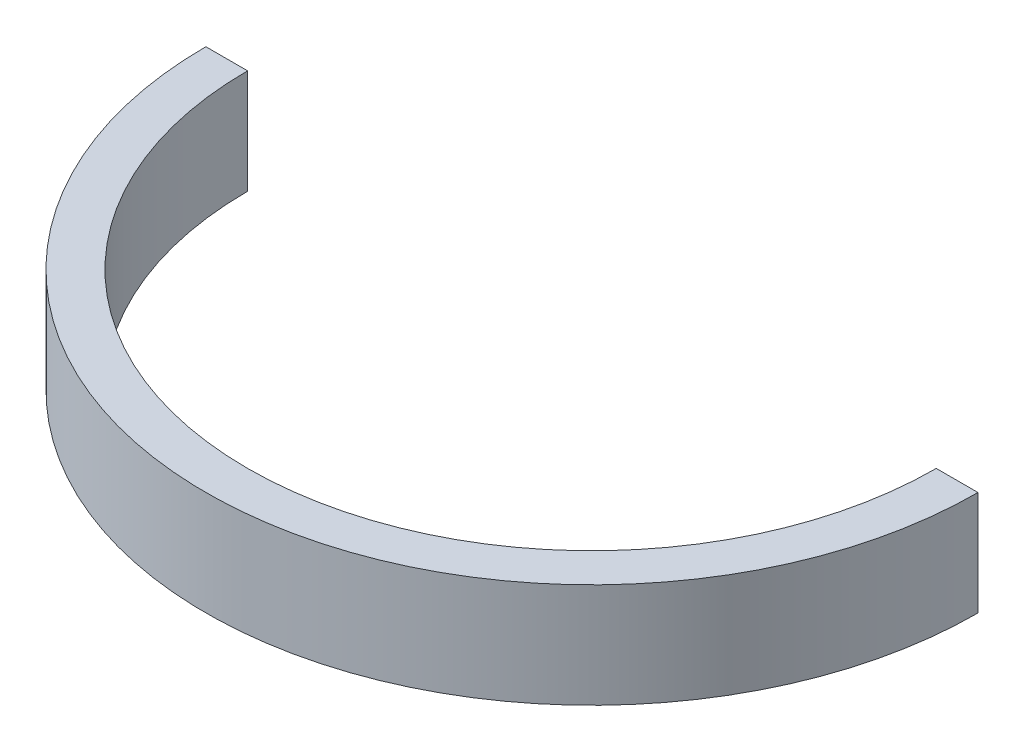
ISO-10303-21;
HEADER;
FILE_DESCRIPTION(('STEP AP214'),'2;1');
FILE_NAME('part.step','',(''),(''),'','','');
FILE_SCHEMA(('AUTOMOTIVE_DESIGN { 1 0 10303 214 1 1 1 1 }'));
ENDSEC;
DATA;
#1=APPLICATION_CONTEXT('core data for automotive mechanical design processes');
#2=APPLICATION_PROTOCOL_DEFINITION('international standard','automotive_design',2000,#1);
#3=PRODUCT_CONTEXT('',#1,'mechanical');
#4=PRODUCT('Part','Part','',(#3));
#5=PRODUCT_RELATED_PRODUCT_CATEGORY('part','',(#4));
#6=PRODUCT_DEFINITION_FORMATION('','',#4);
#7=PRODUCT_DEFINITION_CONTEXT('part definition',#1,'design');
#8=PRODUCT_DEFINITION('design','',#6,#7);
#9=PRODUCT_DEFINITION_SHAPE('','',#8);
#10=(LENGTH_UNIT() NAMED_UNIT(*) SI_UNIT(.MILLI.,.METRE.));
#11=(NAMED_UNIT(*) PLANE_ANGLE_UNIT() SI_UNIT($,.RADIAN.));
#12=(NAMED_UNIT(*) SI_UNIT($,.STERADIAN.) SOLID_ANGLE_UNIT());
#13=UNCERTAINTY_MEASURE_WITH_UNIT(LENGTH_MEASURE(1.E-05),#10,'distance_accuracy_value','');
#14=(GEOMETRIC_REPRESENTATION_CONTEXT(3) GLOBAL_UNCERTAINTY_ASSIGNED_CONTEXT((#13)) GLOBAL_UNIT_ASSIGNED_CONTEXT((#10,
#11,#12)) REPRESENTATION_CONTEXT('',''));
#15=CARTESIAN_POINT('',(0.,0.,0.));
#16=DIRECTION('',(0.,0.,1.));
#17=DIRECTION('',(1.,0.,0.));
#18=AXIS2_PLACEMENT_3D('',#15,#16,#17);
#19=CARTESIAN_POINT('',(0.,20.,0.));
#20=DIRECTION('',(0.,-1.,0.));
#21=DIRECTION('',(0.,0.,-1.));
#22=AXIS2_PLACEMENT_3D('',#19,#20,#21);
#23=CYLINDRICAL_SURFACE('',#22,66.);
#24=CARTESIAN_POINT('',(0.,0.,0.));
#25=DIRECTION('',(0.,-1.,0.));
#26=DIRECTION('',(0.,0.,1.));
#27=AXIS2_PLACEMENT_3D('',#24,#25,#26);
#28=CIRCLE('',#27,66.);
#29=CARTESIAN_POINT('',(66.,0.,0.));
#30=VERTEX_POINT('',#29);
#31=CARTESIAN_POINT('',(-66.,0.,0.));
#32=VERTEX_POINT('',#31);
#33=EDGE_CURVE('E97',#30,#32,#28,.T.);
#34=ORIENTED_EDGE('',*,*,#33,.T.);
#35=DIRECTION('',(0.,-1.,0.));
#36=VECTOR('',#35,1.);
#37=CARTESIAN_POINT('',(-66.,20.,0.));
#38=LINE('',#37,#36);
#39=CARTESIAN_POINT('',(-66.,20.,0.));
#40=VERTEX_POINT('',#39);
#41=EDGE_CURVE('E11',#40,#32,#38,.T.);
#42=ORIENTED_EDGE('',*,*,#41,.F.);
#43=CARTESIAN_POINT('',(0.,20.,0.));
#44=DIRECTION('',(0.,-1.,0.));
#45=DIRECTION('',(0.,0.,1.));
#46=AXIS2_PLACEMENT_3D('',#43,#44,#45);
#47=CIRCLE('',#46,66.);
#48=CARTESIAN_POINT('',(66.,20.,0.));
#49=VERTEX_POINT('',#48);
#50=EDGE_CURVE('E85',#49,#40,#47,.T.);
#51=ORIENTED_EDGE('',*,*,#50,.F.);
#52=DIRECTION('',(0.,-1.,0.));
#53=VECTOR('',#52,1.);
#54=CARTESIAN_POINT('',(66.,20.,0.));
#55=LINE('',#54,#53);
#56=EDGE_CURVE('E93',#49,#30,#55,.T.);
#57=ORIENTED_EDGE('',*,*,#56,.T.);
#58=EDGE_LOOP('',(#34,#42,#51,#57));
#59=FACE_BOUND('',#58,.T.);
#60=ADVANCED_FACE('F34',(#59),#23,.F.);
#61=CARTESIAN_POINT('',(-74.,20.,0.));
#62=DIRECTION('',(0.,0.,1.));
#63=DIRECTION('',(1.,0.,0.));
#64=AXIS2_PLACEMENT_3D('',#61,#62,#63);
#65=PLANE('',#64);
#66=DIRECTION('',(-1.,0.,0.));
#67=VECTOR('',#66,1.);
#68=CARTESIAN_POINT('',(-74.,0.,0.));
#69=LINE('',#68,#67);
#70=CARTESIAN_POINT('',(-74.,0.,0.));
#71=VERTEX_POINT('',#70);
#72=EDGE_CURVE('E89',#32,#71,#69,.T.);
#73=ORIENTED_EDGE('',*,*,#72,.T.);
#74=DIRECTION('',(0.,-1.,0.));
#75=VECTOR('',#74,1.);
#76=CARTESIAN_POINT('',(-74.,20.,0.));
#77=LINE('',#76,#75);
#78=CARTESIAN_POINT('',(-74.,20.,0.));
#79=VERTEX_POINT('',#78);
#80=EDGE_CURVE('E42',#79,#71,#77,.T.);
#81=ORIENTED_EDGE('',*,*,#80,.F.);
#82=DIRECTION('',(-1.,0.,0.));
#83=VECTOR('',#82,1.);
#84=CARTESIAN_POINT('',(-74.,20.,0.));
#85=LINE('',#84,#83);
#86=EDGE_CURVE('E80',#40,#79,#85,.T.);
#87=ORIENTED_EDGE('',*,*,#86,.F.);
#88=ORIENTED_EDGE('',*,*,#41,.T.);
#89=EDGE_LOOP('',(#73,#81,#87,#88));
#90=FACE_BOUND('',#89,.T.);
#91=ADVANCED_FACE('F88',(#90),#65,.F.);
#92=CARTESIAN_POINT('',(0.,20.,0.));
#93=DIRECTION('',(0.,-1.,0.));
#94=DIRECTION('',(0.,0.,-1.));
#95=AXIS2_PLACEMENT_3D('',#92,#93,#94);
#96=CYLINDRICAL_SURFACE('',#95,74.);
#97=CARTESIAN_POINT('',(0.,0.,0.));
#98=DIRECTION('',(0.,1.,0.));
#99=DIRECTION('',(0.,0.,1.));
#100=AXIS2_PLACEMENT_3D('',#97,#98,#99);
#101=CIRCLE('',#100,74.);
#102=CARTESIAN_POINT('',(74.,0.,0.));
#103=VERTEX_POINT('',#102);
#104=EDGE_CURVE('E67',#71,#103,#101,.T.);
#105=ORIENTED_EDGE('',*,*,#104,.T.);
#106=DIRECTION('',(0.,-1.,0.));
#107=VECTOR('',#106,1.);
#108=CARTESIAN_POINT('',(74.,20.,0.));
#109=LINE('',#108,#107);
#110=CARTESIAN_POINT('',(74.,20.,0.));
#111=VERTEX_POINT('',#110);
#112=EDGE_CURVE('E90',#111,#103,#109,.T.);
#113=ORIENTED_EDGE('',*,*,#112,.F.);
#114=CARTESIAN_POINT('',(0.,20.,0.));
#115=DIRECTION('',(0.,1.,0.));
#116=DIRECTION('',(0.,0.,1.));
#117=AXIS2_PLACEMENT_3D('',#114,#115,#116);
#118=CIRCLE('',#117,74.);
#119=EDGE_CURVE('E83',#79,#111,#118,.T.);
#120=ORIENTED_EDGE('',*,*,#119,.F.);
#121=ORIENTED_EDGE('',*,*,#80,.T.);
#122=EDGE_LOOP('',(#105,#113,#120,#121));
#123=FACE_BOUND('',#122,.T.);
#124=ADVANCED_FACE('F91',(#123),#96,.T.);
#125=CARTESIAN_POINT('',(66.,20.,0.));
#126=DIRECTION('',(0.,0.,1.));
#127=DIRECTION('',(1.,0.,0.));
#128=AXIS2_PLACEMENT_3D('',#125,#126,#127);
#129=PLANE('',#128);
#130=DIRECTION('',(-1.,0.,0.));
#131=VECTOR('',#130,1.);
#132=CARTESIAN_POINT('',(66.,0.,0.));
#133=LINE('',#132,#131);
#134=EDGE_CURVE('E73',#103,#30,#133,.T.);
#135=ORIENTED_EDGE('',*,*,#134,.T.);
#136=ORIENTED_EDGE('',*,*,#56,.F.);
#137=DIRECTION('',(-1.,0.,0.));
#138=VECTOR('',#137,1.);
#139=CARTESIAN_POINT('',(66.,20.,0.));
#140=LINE('',#139,#138);
#141=EDGE_CURVE('E50',#111,#49,#140,.T.);
#142=ORIENTED_EDGE('',*,*,#141,.F.);
#143=ORIENTED_EDGE('',*,*,#112,.T.);
#144=EDGE_LOOP('',(#135,#136,#142,#143));
#145=FACE_BOUND('',#144,.T.);
#146=ADVANCED_FACE('F104',(#145),#129,.F.);
#147=CARTESIAN_POINT('',(0.,20.,0.));
#148=DIRECTION('',(0.,1.,0.));
#149=DIRECTION('',(0.,0.,1.));
#150=AXIS2_PLACEMENT_3D('',#147,#148,#149);
#151=PLANE('',#150);
#152=ORIENTED_EDGE('',*,*,#50,.T.);
#153=ORIENTED_EDGE('',*,*,#86,.T.);
#154=ORIENTED_EDGE('',*,*,#119,.T.);
#155=ORIENTED_EDGE('',*,*,#141,.T.);
#156=EDGE_LOOP('',(#152,#153,#154,#155));
#157=FACE_BOUND('',#156,.T.);
#158=ADVANCED_FACE('F81',(#157),#151,.T.);
#159=CARTESIAN_POINT('',(0.,0.,0.));
#160=DIRECTION('',(0.,1.,0.));
#161=DIRECTION('',(0.,0.,1.));
#162=AXIS2_PLACEMENT_3D('',#159,#160,#161);
#163=PLANE('',#162);
#164=ORIENTED_EDGE('',*,*,#33,.F.);
#165=ORIENTED_EDGE('',*,*,#134,.F.);
#166=ORIENTED_EDGE('',*,*,#104,.F.);
#167=ORIENTED_EDGE('',*,*,#72,.F.);
#168=EDGE_LOOP('',(#164,#165,#166,#167));
#169=FACE_BOUND('',#168,.T.);
#170=ADVANCED_FACE('F107',(#169),#163,.F.);
#171=CLOSED_SHELL('',(#60,#91,#124,#146,#158,#170));
#172=MANIFOLD_SOLID_BREP('B2',#171);
#173=ADVANCED_BREP_SHAPE_REPRESENTATION('',(#18,#172),#14);
#174=SHAPE_DEFINITION_REPRESENTATION(#9,#173);
ENDSEC;
END-ISO-10303-21;
